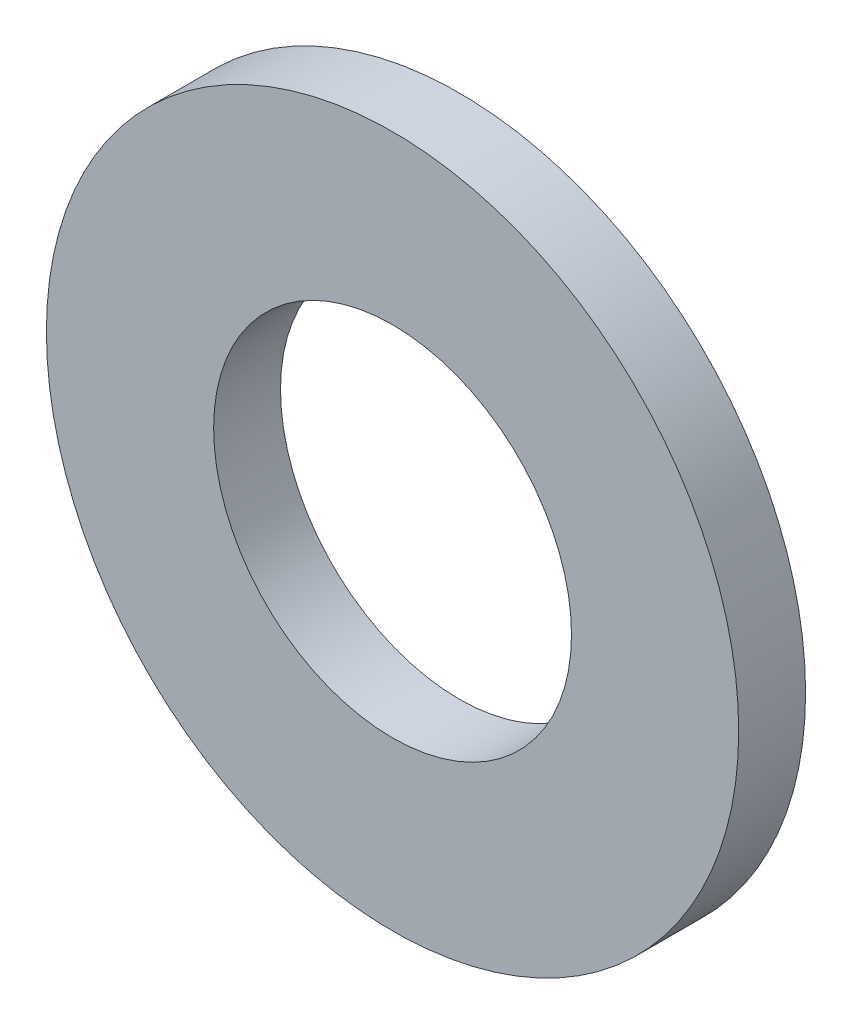
ISO-10303-21;
HEADER;
FILE_DESCRIPTION(('STEP AP214'),'2;1');
FILE_NAME('part.step','',(''),(''),'','','');
FILE_SCHEMA(('AUTOMOTIVE_DESIGN { 1 0 10303 214 1 1 1 1 }'));
ENDSEC;
DATA;
#1=APPLICATION_CONTEXT('core data for automotive mechanical design processes');
#2=APPLICATION_PROTOCOL_DEFINITION('international standard','automotive_design',2000,#1);
#3=PRODUCT_CONTEXT('',#1,'mechanical');
#4=PRODUCT('Part','Part','',(#3));
#5=PRODUCT_RELATED_PRODUCT_CATEGORY('part','',(#4));
#6=PRODUCT_DEFINITION_FORMATION('','',#4);
#7=PRODUCT_DEFINITION_CONTEXT('part definition',#1,'design');
#8=PRODUCT_DEFINITION('design','',#6,#7);
#9=PRODUCT_DEFINITION_SHAPE('','',#8);
#10=(LENGTH_UNIT() NAMED_UNIT(*) SI_UNIT(.MILLI.,.METRE.));
#11=(NAMED_UNIT(*) PLANE_ANGLE_UNIT() SI_UNIT($,.RADIAN.));
#12=(NAMED_UNIT(*) SI_UNIT($,.STERADIAN.) SOLID_ANGLE_UNIT());
#13=UNCERTAINTY_MEASURE_WITH_UNIT(LENGTH_MEASURE(1.E-05),#10,'distance_accuracy_value','');
#14=(GEOMETRIC_REPRESENTATION_CONTEXT(3) GLOBAL_UNCERTAINTY_ASSIGNED_CONTEXT((#13)) GLOBAL_UNIT_ASSIGNED_CONTEXT((#10,
#11,#12)) REPRESENTATION_CONTEXT('',''));
#15=CARTESIAN_POINT('',(0.,0.,0.));
#16=DIRECTION('',(0.,0.,1.));
#17=DIRECTION('',(1.,0.,0.));
#18=AXIS2_PLACEMENT_3D('',#15,#16,#17);
#19=CARTESIAN_POINT('',(0.,0.,2.));
#20=DIRECTION('',(0.,0.,1.));
#21=DIRECTION('',(1.,0.,0.));
#22=AXIS2_PLACEMENT_3D('',#19,#20,#21);
#23=PLANE('',#22);
#24=CARTESIAN_POINT('',(0.,0.,2.));
#25=DIRECTION('',(0.,0.,1.));
#26=DIRECTION('',(1.,0.,0.));
#27=AXIS2_PLACEMENT_3D('',#24,#25,#26);
#28=CIRCLE('',#27,10.35);
#29=CARTESIAN_POINT('',(10.35,0.,2.));
#30=VERTEX_POINT('',#29);
#31=EDGE_CURVE('E10',#30,#30,#28,.T.);
#32=ORIENTED_EDGE('',*,*,#31,.T.);
#33=EDGE_LOOP('',(#32));
#34=FACE_BOUND('',#33,.T.);
#35=CARTESIAN_POINT('',(0.,0.,2.));
#36=DIRECTION('',(0.,0.,1.));
#37=DIRECTION('',(1.,0.,0.));
#38=AXIS2_PLACEMENT_3D('',#35,#36,#37);
#39=CIRCLE('',#38,5.35);
#40=CARTESIAN_POINT('',(5.35,0.,2.));
#41=VERTEX_POINT('',#40);
#42=EDGE_CURVE('E50',#41,#41,#39,.T.);
#43=ORIENTED_EDGE('',*,*,#42,.F.);
#44=EDGE_LOOP('',(#43));
#45=FACE_BOUND('',#44,.T.);
#46=ADVANCED_FACE('F37',(#34,#45),#23,.T.);
#47=CARTESIAN_POINT('',(0.,0.,0.));
#48=DIRECTION('',(0.,0.,1.));
#49=DIRECTION('',(1.,0.,0.));
#50=AXIS2_PLACEMENT_3D('',#47,#48,#49);
#51=PLANE('',#50);
#52=CARTESIAN_POINT('',(0.,0.,0.));
#53=DIRECTION('',(0.,0.,1.));
#54=DIRECTION('',(1.,0.,0.));
#55=AXIS2_PLACEMENT_3D('',#52,#53,#54);
#56=CIRCLE('',#55,10.35);
#57=CARTESIAN_POINT('',(10.35,0.,0.));
#58=VERTEX_POINT('',#57);
#59=EDGE_CURVE('E41',#58,#58,#56,.T.);
#60=ORIENTED_EDGE('',*,*,#59,.F.);
#61=EDGE_LOOP('',(#60));
#62=FACE_BOUND('',#61,.T.);
#63=CARTESIAN_POINT('',(0.,0.,0.));
#64=DIRECTION('',(0.,0.,1.));
#65=DIRECTION('',(1.,0.,0.));
#66=AXIS2_PLACEMENT_3D('',#63,#64,#65);
#67=CIRCLE('',#66,5.35);
#68=CARTESIAN_POINT('',(5.35,0.,0.));
#69=VERTEX_POINT('',#68);
#70=EDGE_CURVE('E52',#69,#69,#67,.T.);
#71=ORIENTED_EDGE('',*,*,#70,.T.);
#72=EDGE_LOOP('',(#71));
#73=FACE_BOUND('',#72,.T.);
#74=ADVANCED_FACE('F64',(#62,#73),#51,.F.);
#75=CARTESIAN_POINT('',(0.,0.,2.));
#76=DIRECTION('',(0.,0.,-1.));
#77=DIRECTION('',(-1.,0.,0.));
#78=AXIS2_PLACEMENT_3D('',#75,#76,#77);
#79=CYLINDRICAL_SURFACE('',#78,10.35);
#80=ORIENTED_EDGE('',*,*,#31,.F.);
#81=EDGE_LOOP('',(#80));
#82=FACE_BOUND('',#81,.T.);
#83=ORIENTED_EDGE('',*,*,#59,.T.);
#84=EDGE_LOOP('',(#83));
#85=FACE_BOUND('',#84,.T.);
#86=ADVANCED_FACE('F39',(#82,#85),#79,.T.);
#87=CARTESIAN_POINT('',(0.,0.,2.));
#88=DIRECTION('',(0.,0.,-1.));
#89=DIRECTION('',(-1.,0.,0.));
#90=AXIS2_PLACEMENT_3D('',#87,#88,#89);
#91=CYLINDRICAL_SURFACE('',#90,5.35);
#92=ORIENTED_EDGE('',*,*,#42,.T.);
#93=EDGE_LOOP('',(#92));
#94=FACE_BOUND('',#93,.T.);
#95=ORIENTED_EDGE('',*,*,#70,.F.);
#96=EDGE_LOOP('',(#95));
#97=FACE_BOUND('',#96,.T.);
#98=ADVANCED_FACE('F60',(#94,#97),#91,.F.);
#99=CLOSED_SHELL('',(#46,#74,#86,#98));
#100=MANIFOLD_SOLID_BREP('B2',#99);
#101=ADVANCED_BREP_SHAPE_REPRESENTATION('',(#18,#100),#14);
#102=SHAPE_DEFINITION_REPRESENTATION(#9,#101);
ENDSEC;
END-ISO-10303-21;
